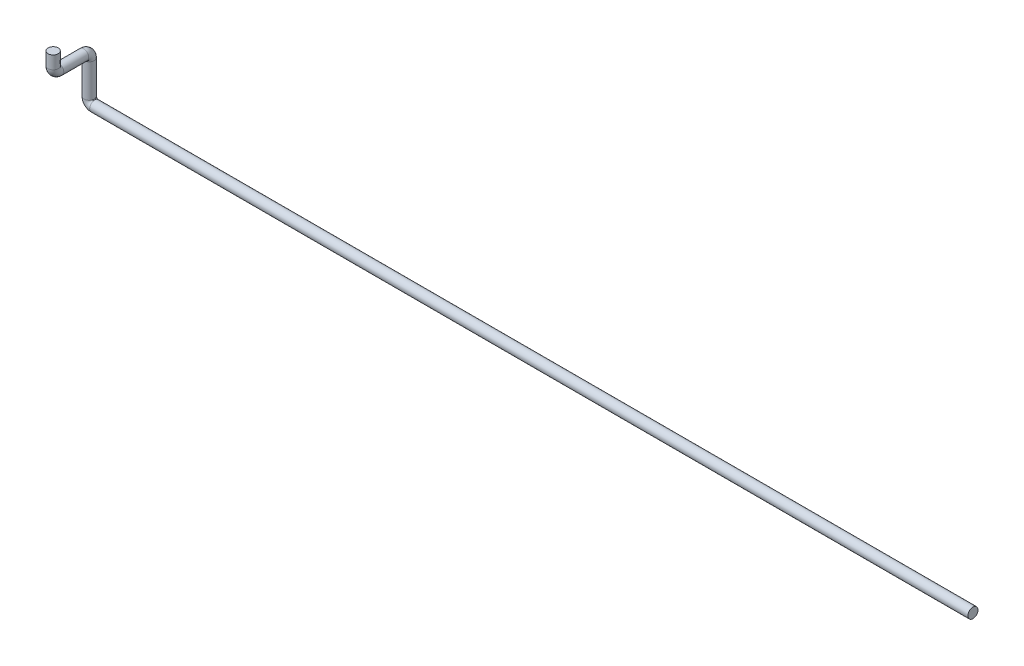
ISO-10303-21;
HEADER;
FILE_DESCRIPTION(('STEP AP214'),'2;1');
FILE_NAME('part.step','',(''),(''),'','','');
FILE_SCHEMA(('AUTOMOTIVE_DESIGN { 1 0 10303 214 1 1 1 1 }'));
ENDSEC;
DATA;
#1=APPLICATION_CONTEXT('core data for automotive mechanical design processes');
#2=APPLICATION_PROTOCOL_DEFINITION('international standard','automotive_design',2000,#1);
#3=PRODUCT_CONTEXT('',#1,'mechanical');
#4=PRODUCT('Part','Part','',(#3));
#5=PRODUCT_RELATED_PRODUCT_CATEGORY('part','',(#4));
#6=PRODUCT_DEFINITION_FORMATION('','',#4);
#7=PRODUCT_DEFINITION_CONTEXT('part definition',#1,'design');
#8=PRODUCT_DEFINITION('design','',#6,#7);
#9=PRODUCT_DEFINITION_SHAPE('','',#8);
#10=(LENGTH_UNIT() NAMED_UNIT(*) SI_UNIT(.MILLI.,.METRE.));
#11=(NAMED_UNIT(*) PLANE_ANGLE_UNIT() SI_UNIT($,.RADIAN.));
#12=(NAMED_UNIT(*) SI_UNIT($,.STERADIAN.) SOLID_ANGLE_UNIT());
#13=UNCERTAINTY_MEASURE_WITH_UNIT(LENGTH_MEASURE(1.E-05),#10,'distance_accuracy_value','');
#14=(GEOMETRIC_REPRESENTATION_CONTEXT(3) GLOBAL_UNCERTAINTY_ASSIGNED_CONTEXT((#13)) GLOBAL_UNIT_ASSIGNED_CONTEXT((#10,
#11,#12)) REPRESENTATION_CONTEXT('',''));
#15=CARTESIAN_POINT('',(0.,0.,0.));
#16=DIRECTION('',(0.,0.,1.));
#17=DIRECTION('',(1.,0.,0.));
#18=AXIS2_PLACEMENT_3D('',#15,#16,#17);
#19=CARTESIAN_POINT('',(0.,0.,0.));
#20=DIRECTION('',(1.,0.,0.));
#21=DIRECTION('',(0.,0.,-1.));
#22=AXIS2_PLACEMENT_3D('',#19,#20,#21);
#23=PLANE('',#22);
#24=CARTESIAN_POINT('',(0.,0.,0.));
#25=DIRECTION('',(1.,0.,0.));
#26=DIRECTION('',(0.,0.,-1.));
#27=AXIS2_PLACEMENT_3D('',#24,#25,#26);
#28=CIRCLE('',#27,13.7);
#29=CARTESIAN_POINT('',(0.,0.,-13.7));
#30=VERTEX_POINT('',#29);
#31=EDGE_CURVE('E47',#30,#30,#28,.T.);
#32=ORIENTED_EDGE('',*,*,#31,.T.);
#33=EDGE_LOOP('',(#32));
#34=FACE_BOUND('',#33,.T.);
#35=ADVANCED_FACE('F35',(#34),#23,.T.);
#36=CARTESIAN_POINT('',(-2389.,170.,97.5));
#37=DIRECTION('',(0.,-1.,0.));
#38=DIRECTION('',(0.,0.,-1.));
#39=AXIS2_PLACEMENT_3D('',#36,#37,#38);
#40=PLANE('',#39);
#41=CARTESIAN_POINT('',(-2389.,170.,97.5));
#42=DIRECTION('',(0.,-1.,0.));
#43=DIRECTION('',(0.,0.,-1.));
#44=AXIS2_PLACEMENT_3D('',#41,#42,#43);
#45=CIRCLE('',#44,13.7);
#46=CARTESIAN_POINT('',(-2389.,170.,83.8));
#47=VERTEX_POINT('',#46);
#48=EDGE_CURVE('E11',#47,#47,#45,.T.);
#49=ORIENTED_EDGE('',*,*,#48,.F.);
#50=EDGE_LOOP('',(#49));
#51=FACE_BOUND('',#50,.T.);
#52=ADVANCED_FACE('F53',(#51),#40,.F.);
#53=CARTESIAN_POINT('',(0.,0.,0.));
#54=DIRECTION('',(-1.,0.,0.));
#55=DIRECTION('',(0.,0.,1.));
#56=AXIS2_PLACEMENT_3D('',#53,#54,#55);
#57=CYLINDRICAL_SURFACE('',#56,13.7);
#58=CARTESIAN_POINT('',(-2374.,0.,0.));
#59=DIRECTION('',(1.,0.,0.));
#60=DIRECTION('',(0.,0.,-1.));
#61=AXIS2_PLACEMENT_3D('',#58,#59,#60);
#62=CIRCLE('',#61,13.7);
#63=CARTESIAN_POINT('',(-2374.,-13.7000000000001,0.));
#64=VERTEX_POINT('',#63);
#65=EDGE_CURVE('E95',#64,#64,#62,.T.);
#66=ORIENTED_EDGE('',*,*,#65,.T.);
#67=EDGE_LOOP('',(#66));
#68=FACE_BOUND('',#67,.T.);
#69=ORIENTED_EDGE('',*,*,#31,.F.);
#70=EDGE_LOOP('',(#69));
#71=FACE_BOUND('',#70,.T.);
#72=ADVANCED_FACE('F55',(#68,#71),#57,.T.);
#73=CARTESIAN_POINT('',(-2374.,15.,0.));
#74=DIRECTION('',(0.,0.,-1.));
#75=DIRECTION('',(-1.,0.,0.));
#76=AXIS2_PLACEMENT_3D('',#73,#74,#75);
#77=TOROIDAL_SURFACE('',#76,15.0000000000001,13.7);
#78=CARTESIAN_POINT('',(-2389.,15.,0.));
#79=DIRECTION('',(0.,-1.,0.));
#80=DIRECTION('',(0.,0.,-1.));
#81=AXIS2_PLACEMENT_3D('',#78,#79,#80);
#82=CIRCLE('',#81,13.7);
#83=CARTESIAN_POINT('',(-2402.7,15.,0.));
#84=VERTEX_POINT('',#83);
#85=EDGE_CURVE('E92',#84,#84,#82,.T.);
#86=CARTESIAN_POINT('',(-2374.,15.,0.));
#87=DIRECTION('',(0.,0.,-1.));
#88=DIRECTION('',(-1.,0.,0.));
#89=AXIS2_PLACEMENT_3D('',#86,#87,#88);
#90=CIRCLE('',#89,28.7000000000001);
#91=EDGE_CURVE('',#64,#84,#90,.T.);
#92=ORIENTED_EDGE('',*,*,#65,.F.);
#93=ORIENTED_EDGE('',*,*,#85,.T.);
#94=ORIENTED_EDGE('',*,*,#91,.T.);
#95=ORIENTED_EDGE('',*,*,#91,.F.);
#96=EDGE_LOOP('',(#92,#94,#93,#95));
#97=FACE_BOUND('',#96,.T.);
#98=ADVANCED_FACE('F60',(#97),#77,.T.);
#99=CARTESIAN_POINT('',(-2389.,15.,0.));
#100=DIRECTION('',(0.,1.,0.));
#101=DIRECTION('',(0.,0.,1.));
#102=AXIS2_PLACEMENT_3D('',#99,#100,#101);
#103=CYLINDRICAL_SURFACE('',#102,13.7);
#104=CARTESIAN_POINT('',(-2389.,105.,0.));
#105=DIRECTION('',(0.,-1.,0.));
#106=DIRECTION('',(0.,0.,-1.));
#107=AXIS2_PLACEMENT_3D('',#104,#105,#106);
#108=CIRCLE('',#107,13.7);
#109=CARTESIAN_POINT('',(-2389.,105.,-13.7));
#110=VERTEX_POINT('',#109);
#111=EDGE_CURVE('E97',#110,#110,#108,.T.);
#112=ORIENTED_EDGE('',*,*,#111,.T.);
#113=EDGE_LOOP('',(#112));
#114=FACE_BOUND('',#113,.T.);
#115=ORIENTED_EDGE('',*,*,#85,.F.);
#116=EDGE_LOOP('',(#115));
#117=FACE_BOUND('',#116,.T.);
#118=ADVANCED_FACE('F80',(#114,#117),#103,.T.);
#119=CARTESIAN_POINT('',(-2389.,105.,15.));
#120=DIRECTION('',(1.,0.,0.));
#121=DIRECTION('',(0.,0.,-1.));
#122=AXIS2_PLACEMENT_3D('',#119,#120,#121);
#123=TOROIDAL_SURFACE('',#122,15.,13.7);
#124=CARTESIAN_POINT('',(-2389.,120.,15.));
#125=DIRECTION('',(0.,0.,-1.));
#126=DIRECTION('',(0.,1.,0.));
#127=AXIS2_PLACEMENT_3D('',#124,#125,#126);
#128=CIRCLE('',#127,13.7);
#129=CARTESIAN_POINT('',(-2389.,133.7,15.));
#130=VERTEX_POINT('',#129);
#131=EDGE_CURVE('E103',#130,#130,#128,.T.);
#132=CARTESIAN_POINT('',(-2389.,105.,15.));
#133=DIRECTION('',(1.,0.,0.));
#134=DIRECTION('',(0.,0.,-1.));
#135=AXIS2_PLACEMENT_3D('',#132,#133,#134);
#136=CIRCLE('',#135,28.7);
#137=EDGE_CURVE('',#110,#130,#136,.T.);
#138=ORIENTED_EDGE('',*,*,#111,.F.);
#139=ORIENTED_EDGE('',*,*,#131,.T.);
#140=ORIENTED_EDGE('',*,*,#137,.T.);
#141=ORIENTED_EDGE('',*,*,#137,.F.);
#142=EDGE_LOOP('',(#138,#140,#139,#141));
#143=FACE_BOUND('',#142,.T.);
#144=ADVANCED_FACE('F76',(#143),#123,.T.);
#145=CARTESIAN_POINT('',(-2389.,120.,15.));
#146=DIRECTION('',(0.,0.,1.));
#147=DIRECTION('',(1.,0.,0.));
#148=AXIS2_PLACEMENT_3D('',#145,#146,#147);
#149=CYLINDRICAL_SURFACE('',#148,13.7);
#150=CARTESIAN_POINT('',(-2389.,120.,82.5));
#151=DIRECTION('',(0.,0.,-1.));
#152=DIRECTION('',(0.,1.,0.));
#153=AXIS2_PLACEMENT_3D('',#150,#151,#152);
#154=CIRCLE('',#153,13.7);
#155=CARTESIAN_POINT('',(-2389.,106.3,82.5));
#156=VERTEX_POINT('',#155);
#157=EDGE_CURVE('E106',#156,#156,#154,.T.);
#158=ORIENTED_EDGE('',*,*,#157,.T.);
#159=EDGE_LOOP('',(#158));
#160=FACE_BOUND('',#159,.T.);
#161=ORIENTED_EDGE('',*,*,#131,.F.);
#162=EDGE_LOOP('',(#161));
#163=FACE_BOUND('',#162,.T.);
#164=ADVANCED_FACE('F70',(#160,#163),#149,.T.);
#165=CARTESIAN_POINT('',(-2389.,135.,82.5));
#166=DIRECTION('',(-1.,0.,0.));
#167=DIRECTION('',(0.,0.,1.));
#168=AXIS2_PLACEMENT_3D('',#165,#166,#167);
#169=TOROIDAL_SURFACE('',#168,15.,13.7);
#170=CARTESIAN_POINT('',(-2389.,135.,97.5));
#171=DIRECTION('',(0.,-1.,0.));
#172=DIRECTION('',(0.,0.,-1.));
#173=AXIS2_PLACEMENT_3D('',#170,#171,#172);
#174=CIRCLE('',#173,13.7);
#175=CARTESIAN_POINT('',(-2389.,135.,111.2));
#176=VERTEX_POINT('',#175);
#177=EDGE_CURVE('E42',#176,#176,#174,.T.);
#178=CARTESIAN_POINT('',(-2389.,135.,82.5));
#179=DIRECTION('',(-1.,0.,0.));
#180=DIRECTION('',(0.,0.,1.));
#181=AXIS2_PLACEMENT_3D('',#178,#179,#180);
#182=CIRCLE('',#181,28.7);
#183=EDGE_CURVE('',#156,#176,#182,.T.);
#184=ORIENTED_EDGE('',*,*,#157,.F.);
#185=ORIENTED_EDGE('',*,*,#177,.T.);
#186=ORIENTED_EDGE('',*,*,#183,.T.);
#187=ORIENTED_EDGE('',*,*,#183,.F.);
#188=EDGE_LOOP('',(#184,#186,#185,#187));
#189=FACE_BOUND('',#188,.T.);
#190=ADVANCED_FACE('F66',(#189),#169,.T.);
#191=CARTESIAN_POINT('',(-2389.,135.,97.5));
#192=DIRECTION('',(0.,1.,0.));
#193=DIRECTION('',(0.,0.,1.));
#194=AXIS2_PLACEMENT_3D('',#191,#192,#193);
#195=CYLINDRICAL_SURFACE('',#194,13.7);
#196=ORIENTED_EDGE('',*,*,#48,.T.);
#197=EDGE_LOOP('',(#196));
#198=FACE_BOUND('',#197,.T.);
#199=ORIENTED_EDGE('',*,*,#177,.F.);
#200=EDGE_LOOP('',(#199));
#201=FACE_BOUND('',#200,.T.);
#202=ADVANCED_FACE('F50',(#198,#201),#195,.T.);
#203=CLOSED_SHELL('',(#35,#52,#72,#98,#118,#144,#164,#190,#202));
#204=MANIFOLD_SOLID_BREP('B2',#203);
#205=ADVANCED_BREP_SHAPE_REPRESENTATION('',(#18,#204),#14);
#206=SHAPE_DEFINITION_REPRESENTATION(#9,#205);
ENDSEC;
END-ISO-10303-21;
